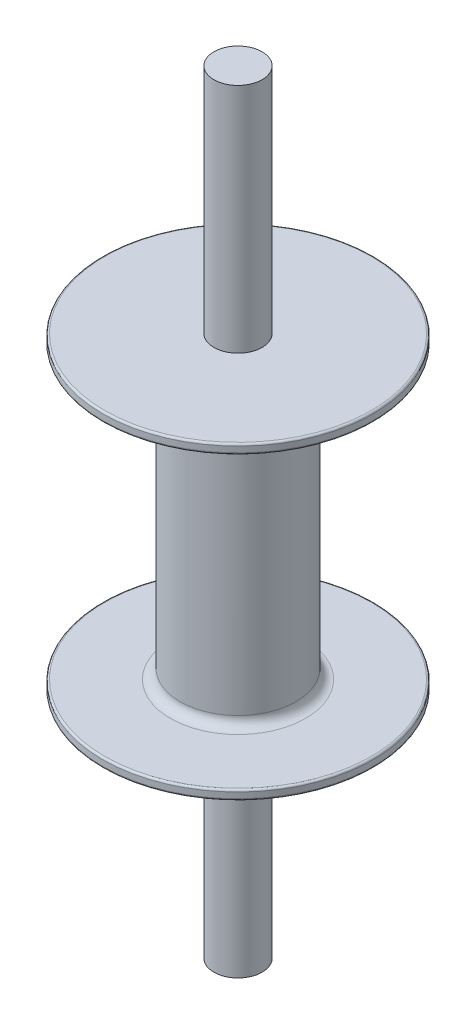
ISO-10303-21;
HEADER;
FILE_DESCRIPTION(('STEP AP214'),'2;1');
FILE_NAME('part.step','',(''),(''),'','','');
FILE_SCHEMA(('AUTOMOTIVE_DESIGN { 1 0 10303 214 1 1 1 1 }'));
ENDSEC;
DATA;
#1=APPLICATION_CONTEXT('core data for automotive mechanical design processes');
#2=APPLICATION_PROTOCOL_DEFINITION('international standard','automotive_design',2000,#1);
#3=PRODUCT_CONTEXT('',#1,'mechanical');
#4=PRODUCT('Part','Part','',(#3));
#5=PRODUCT_RELATED_PRODUCT_CATEGORY('part','',(#4));
#6=PRODUCT_DEFINITION_FORMATION('','',#4);
#7=PRODUCT_DEFINITION_CONTEXT('part definition',#1,'design');
#8=PRODUCT_DEFINITION('design','',#6,#7);
#9=PRODUCT_DEFINITION_SHAPE('','',#8);
#10=(LENGTH_UNIT() NAMED_UNIT(*) SI_UNIT(.MILLI.,.METRE.));
#11=(NAMED_UNIT(*) PLANE_ANGLE_UNIT() SI_UNIT($,.RADIAN.));
#12=(NAMED_UNIT(*) SI_UNIT($,.STERADIAN.) SOLID_ANGLE_UNIT());
#13=UNCERTAINTY_MEASURE_WITH_UNIT(LENGTH_MEASURE(1.E-05),#10,'distance_accuracy_value','');
#14=(GEOMETRIC_REPRESENTATION_CONTEXT(3) GLOBAL_UNCERTAINTY_ASSIGNED_CONTEXT((#13)) GLOBAL_UNIT_ASSIGNED_CONTEXT((#10,
#11,#12)) REPRESENTATION_CONTEXT('',''));
#15=CARTESIAN_POINT('',(0.,0.,0.));
#16=DIRECTION('',(0.,0.,1.));
#17=DIRECTION('',(1.,0.,0.));
#18=AXIS2_PLACEMENT_3D('',#15,#16,#17);
#19=CARTESIAN_POINT('',(0.,-150.,0.));
#20=DIRECTION('',(0.,1.,0.));
#21=DIRECTION('',(0.,0.,1.));
#22=AXIS2_PLACEMENT_3D('',#19,#20,#21);
#23=CYLINDRICAL_SURFACE('',#22,60.);
#24=CARTESIAN_POINT('',(0.,-140.,0.));
#25=DIRECTION('',(0.,-1.,0.));
#26=DIRECTION('',(0.,0.,-1.));
#27=AXIS2_PLACEMENT_3D('',#24,#25,#26);
#28=CIRCLE('',#27,60.);
#29=CARTESIAN_POINT('',(0.,-140.,-60.));
#30=VERTEX_POINT('',#29);
#31=EDGE_CURVE('E66',#30,#30,#28,.F.);
#32=ORIENTED_EDGE('',*,*,#31,.T.);
#33=EDGE_LOOP('',(#32));
#34=FACE_BOUND('',#33,.T.);
#35=CARTESIAN_POINT('',(0.,140.,0.));
#36=DIRECTION('',(0.,1.,0.));
#37=DIRECTION('',(0.,0.,1.));
#38=AXIS2_PLACEMENT_3D('',#35,#36,#37);
#39=CIRCLE('',#38,60.);
#40=CARTESIAN_POINT('',(0.,140.,60.));
#41=VERTEX_POINT('',#40);
#42=EDGE_CURVE('E69',#41,#41,#39,.F.);
#43=ORIENTED_EDGE('',*,*,#42,.T.);
#44=EDGE_LOOP('',(#43));
#45=FACE_BOUND('',#44,.T.);
#46=ADVANCED_FACE('F31',(#34,#45),#23,.T.);
#47=CARTESIAN_POINT('',(0.,160.,0.));
#48=DIRECTION('',(0.,-1.,0.));
#49=DIRECTION('',(0.,0.,-1.));
#50=AXIS2_PLACEMENT_3D('',#47,#48,#49);
#51=CYLINDRICAL_SURFACE('',#50,140.);
#52=CARTESIAN_POINT('',(0.,158.,0.));
#53=DIRECTION('',(0.,1.,0.));
#54=DIRECTION('',(0.,0.,1.));
#55=AXIS2_PLACEMENT_3D('',#52,#53,#54);
#56=CIRCLE('',#55,140.);
#57=CARTESIAN_POINT('',(0.,158.,140.));
#58=VERTEX_POINT('',#57);
#59=EDGE_CURVE('E42',#58,#58,#56,.F.);
#60=ORIENTED_EDGE('',*,*,#59,.T.);
#61=EDGE_LOOP('',(#60));
#62=FACE_BOUND('',#61,.T.);
#63=CARTESIAN_POINT('',(0.,152.,0.));
#64=DIRECTION('',(0.,1.,0.));
#65=DIRECTION('',(0.,0.,1.));
#66=AXIS2_PLACEMENT_3D('',#63,#64,#65);
#67=CIRCLE('',#66,140.);
#68=CARTESIAN_POINT('',(0.,152.,140.));
#69=VERTEX_POINT('',#68);
#70=EDGE_CURVE('E60',#69,#69,#67,.T.);
#71=ORIENTED_EDGE('',*,*,#70,.T.);
#72=EDGE_LOOP('',(#71));
#73=FACE_BOUND('',#72,.T.);
#74=ADVANCED_FACE('F106',(#62,#73),#51,.T.);
#75=CARTESIAN_POINT('',(0.,160.,0.));
#76=DIRECTION('',(0.,1.,0.));
#77=DIRECTION('',(0.,0.,1.));
#78=AXIS2_PLACEMENT_3D('',#75,#76,#77);
#79=PLANE('',#78);
#80=CARTESIAN_POINT('',(0.,160.,0.));
#81=DIRECTION('',(0.,1.,0.));
#82=DIRECTION('',(0.,0.,1.));
#83=AXIS2_PLACEMENT_3D('',#80,#81,#82);
#84=CIRCLE('',#83,138.);
#85=CARTESIAN_POINT('',(0.,160.,138.));
#86=VERTEX_POINT('',#85);
#87=EDGE_CURVE('E46',#86,#86,#84,.T.);
#88=ORIENTED_EDGE('',*,*,#87,.T.);
#89=EDGE_LOOP('',(#88));
#90=FACE_BOUND('',#89,.T.);
#91=CARTESIAN_POINT('',(0.,160.,0.));
#92=DIRECTION('',(0.,1.,0.));
#93=DIRECTION('',(0.,0.,1.));
#94=AXIS2_PLACEMENT_3D('',#91,#92,#93);
#95=CIRCLE('',#94,25.);
#96=CARTESIAN_POINT('',(0.,160.,25.));
#97=VERTEX_POINT('',#96);
#98=EDGE_CURVE('E75',#97,#97,#95,.T.);
#99=ORIENTED_EDGE('',*,*,#98,.F.);
#100=EDGE_LOOP('',(#99));
#101=FACE_BOUND('',#100,.T.);
#102=ADVANCED_FACE('F112',(#90,#101),#79,.T.);
#103=CARTESIAN_POINT('',(0.,150.,0.));
#104=DIRECTION('',(0.,1.,0.));
#105=DIRECTION('',(0.,0.,1.));
#106=AXIS2_PLACEMENT_3D('',#103,#104,#105);
#107=PLANE('',#106);
#108=CARTESIAN_POINT('',(0.,150.,0.));
#109=DIRECTION('',(0.,1.,0.));
#110=DIRECTION('',(0.,0.,1.));
#111=AXIS2_PLACEMENT_3D('',#108,#109,#110);
#112=CIRCLE('',#111,138.);
#113=CARTESIAN_POINT('',(0.,150.,138.));
#114=VERTEX_POINT('',#113);
#115=EDGE_CURVE('E57',#114,#114,#112,.F.);
#116=ORIENTED_EDGE('',*,*,#115,.T.);
#117=EDGE_LOOP('',(#116));
#118=FACE_BOUND('',#117,.T.);
#119=CARTESIAN_POINT('',(0.,150.,0.));
#120=DIRECTION('',(0.,1.,0.));
#121=DIRECTION('',(0.,0.,1.));
#122=AXIS2_PLACEMENT_3D('',#119,#120,#121);
#123=CIRCLE('',#122,70.);
#124=CARTESIAN_POINT('',(0.,150.,70.));
#125=VERTEX_POINT('',#124);
#126=EDGE_CURVE('E72',#125,#125,#123,.T.);
#127=ORIENTED_EDGE('',*,*,#126,.T.);
#128=EDGE_LOOP('',(#127));
#129=FACE_BOUND('',#128,.T.);
#130=ADVANCED_FACE('F145',(#118,#129),#107,.F.);
#131=CARTESIAN_POINT('',(0.,-160.,0.));
#132=DIRECTION('',(0.,1.,0.));
#133=DIRECTION('',(0.,0.,1.));
#134=AXIS2_PLACEMENT_3D('',#131,#132,#133);
#135=CYLINDRICAL_SURFACE('',#134,140.);
#136=CARTESIAN_POINT('',(0.,-158.,0.));
#137=DIRECTION('',(0.,-1.,0.));
#138=DIRECTION('',(0.,0.,-1.));
#139=AXIS2_PLACEMENT_3D('',#136,#137,#138);
#140=CIRCLE('',#139,140.);
#141=CARTESIAN_POINT('',(0.,-158.,-140.));
#142=VERTEX_POINT('',#141);
#143=EDGE_CURVE('E38',#142,#142,#140,.F.);
#144=ORIENTED_EDGE('',*,*,#143,.T.);
#145=EDGE_LOOP('',(#144));
#146=FACE_BOUND('',#145,.T.);
#147=CARTESIAN_POINT('',(0.,-152.,0.));
#148=DIRECTION('',(0.,-1.,0.));
#149=DIRECTION('',(0.,0.,-1.));
#150=AXIS2_PLACEMENT_3D('',#147,#148,#149);
#151=CIRCLE('',#150,140.);
#152=CARTESIAN_POINT('',(0.,-152.,-140.));
#153=VERTEX_POINT('',#152);
#154=EDGE_CURVE('E51',#153,#153,#151,.T.);
#155=ORIENTED_EDGE('',*,*,#154,.T.);
#156=EDGE_LOOP('',(#155));
#157=FACE_BOUND('',#156,.T.);
#158=ADVANCED_FACE('F151',(#146,#157),#135,.T.);
#159=CARTESIAN_POINT('',(0.,-160.,0.));
#160=DIRECTION('',(0.,-1.,0.));
#161=DIRECTION('',(0.,0.,1.));
#162=AXIS2_PLACEMENT_3D('',#159,#160,#161);
#163=PLANE('',#162);
#164=CARTESIAN_POINT('',(0.,-160.,0.));
#165=DIRECTION('',(0.,-1.,0.));
#166=DIRECTION('',(0.,0.,-1.));
#167=AXIS2_PLACEMENT_3D('',#164,#165,#166);
#168=CIRCLE('',#167,138.);
#169=CARTESIAN_POINT('',(0.,-160.,-138.));
#170=VERTEX_POINT('',#169);
#171=EDGE_CURVE('E10',#170,#170,#168,.T.);
#172=ORIENTED_EDGE('',*,*,#171,.T.);
#173=EDGE_LOOP('',(#172));
#174=FACE_BOUND('',#173,.T.);
#175=CARTESIAN_POINT('',(0.,-160.,0.));
#176=DIRECTION('',(0.,-1.,0.));
#177=DIRECTION('',(0.,0.,-1.));
#178=AXIS2_PLACEMENT_3D('',#175,#176,#177);
#179=CIRCLE('',#178,25.);
#180=CARTESIAN_POINT('',(0.,-160.,-25.));
#181=VERTEX_POINT('',#180);
#182=EDGE_CURVE('E76',#181,#181,#179,.T.);
#183=ORIENTED_EDGE('',*,*,#182,.F.);
#184=EDGE_LOOP('',(#183));
#185=FACE_BOUND('',#184,.T.);
#186=ADVANCED_FACE('F156',(#174,#185),#163,.T.);
#187=CARTESIAN_POINT('',(0.,-150.,0.));
#188=DIRECTION('',(0.,-1.,0.));
#189=DIRECTION('',(0.,0.,1.));
#190=AXIS2_PLACEMENT_3D('',#187,#188,#189);
#191=PLANE('',#190);
#192=CARTESIAN_POINT('',(0.,-150.,0.));
#193=DIRECTION('',(0.,-1.,0.));
#194=DIRECTION('',(0.,0.,-1.));
#195=AXIS2_PLACEMENT_3D('',#192,#193,#194);
#196=CIRCLE('',#195,138.);
#197=CARTESIAN_POINT('',(0.,-150.,-138.));
#198=VERTEX_POINT('',#197);
#199=EDGE_CURVE('E54',#198,#198,#196,.F.);
#200=ORIENTED_EDGE('',*,*,#199,.T.);
#201=EDGE_LOOP('',(#200));
#202=FACE_BOUND('',#201,.T.);
#203=CARTESIAN_POINT('',(0.,-150.,0.));
#204=DIRECTION('',(0.,-1.,0.));
#205=DIRECTION('',(0.,0.,-1.));
#206=AXIS2_PLACEMENT_3D('',#203,#204,#205);
#207=CIRCLE('',#206,70.);
#208=CARTESIAN_POINT('',(0.,-150.,-70.));
#209=VERTEX_POINT('',#208);
#210=EDGE_CURVE('E63',#209,#209,#207,.T.);
#211=ORIENTED_EDGE('',*,*,#210,.T.);
#212=EDGE_LOOP('',(#211));
#213=FACE_BOUND('',#212,.T.);
#214=ADVANCED_FACE('F157',(#202,#213),#191,.F.);
#215=CARTESIAN_POINT('',(0.,-400.,0.));
#216=DIRECTION('',(0.,1.,0.));
#217=DIRECTION('',(0.,0.,1.));
#218=AXIS2_PLACEMENT_3D('',#215,#216,#217);
#219=PLANE('',#218);
#220=CARTESIAN_POINT('',(0.,-400.,0.));
#221=DIRECTION('',(0.,1.,0.));
#222=DIRECTION('',(0.,0.,1.));
#223=AXIS2_PLACEMENT_3D('',#220,#221,#222);
#224=CIRCLE('',#223,25.);
#225=CARTESIAN_POINT('',(0.,-400.,25.));
#226=VERTEX_POINT('',#225);
#227=EDGE_CURVE('E79',#226,#226,#224,.T.);
#228=ORIENTED_EDGE('',*,*,#227,.F.);
#229=EDGE_LOOP('',(#228));
#230=FACE_BOUND('',#229,.T.);
#231=ADVANCED_FACE('F101',(#230),#219,.F.);
#232=CARTESIAN_POINT('',(0.,-400.,0.));
#233=DIRECTION('',(0.,1.,0.));
#234=DIRECTION('',(0.,0.,1.));
#235=AXIS2_PLACEMENT_3D('',#232,#233,#234);
#236=CYLINDRICAL_SURFACE('',#235,25.);
#237=ORIENTED_EDGE('',*,*,#182,.T.);
#238=EDGE_LOOP('',(#237));
#239=FACE_BOUND('',#238,.T.);
#240=ORIENTED_EDGE('',*,*,#227,.T.);
#241=EDGE_LOOP('',(#240));
#242=FACE_BOUND('',#241,.T.);
#243=ADVANCED_FACE('F92',(#239,#242),#236,.T.);
#244=ORIENTED_EDGE('',*,*,#98,.T.);
#245=EDGE_LOOP('',(#244));
#246=FACE_BOUND('',#245,.T.);
#247=CARTESIAN_POINT('',(0.,400.,0.));
#248=DIRECTION('',(0.,1.,0.));
#249=DIRECTION('',(0.,0.,1.));
#250=AXIS2_PLACEMENT_3D('',#247,#248,#249);
#251=CIRCLE('',#250,25.);
#252=CARTESIAN_POINT('',(0.,400.,25.));
#253=VERTEX_POINT('',#252);
#254=EDGE_CURVE('E84',#253,#253,#251,.T.);
#255=ORIENTED_EDGE('',*,*,#254,.F.);
#256=EDGE_LOOP('',(#255));
#257=FACE_BOUND('',#256,.T.);
#258=ADVANCED_FACE('F90',(#246,#257),#236,.T.);
#259=CARTESIAN_POINT('',(0.,400.,0.));
#260=DIRECTION('',(0.,1.,0.));
#261=DIRECTION('',(0.,0.,1.));
#262=AXIS2_PLACEMENT_3D('',#259,#260,#261);
#263=PLANE('',#262);
#264=ORIENTED_EDGE('',*,*,#254,.T.);
#265=EDGE_LOOP('',(#264));
#266=FACE_BOUND('',#265,.T.);
#267=ADVANCED_FACE('F88',(#266),#263,.T.);
#268=CARTESIAN_POINT('',(0.,140.,0.));
#269=DIRECTION('',(0.,1.,0.));
#270=DIRECTION('',(0.,0.,1.));
#271=AXIS2_PLACEMENT_3D('',#268,#269,#270);
#272=TOROIDAL_SURFACE('',#271,70.,10.);
#273=ORIENTED_EDGE('',*,*,#42,.F.);
#274=EDGE_LOOP('',(#273));
#275=FACE_BOUND('',#274,.T.);
#276=ORIENTED_EDGE('',*,*,#126,.F.);
#277=EDGE_LOOP('',(#276));
#278=FACE_BOUND('',#277,.T.);
#279=ADVANCED_FACE('F99',(#275,#278),#272,.F.);
#280=CARTESIAN_POINT('',(0.,-140.,0.));
#281=DIRECTION('',(0.,-1.,0.));
#282=DIRECTION('',(0.,0.,-1.));
#283=AXIS2_PLACEMENT_3D('',#280,#281,#282);
#284=TOROIDAL_SURFACE('',#283,70.,10.);
#285=ORIENTED_EDGE('',*,*,#210,.F.);
#286=EDGE_LOOP('',(#285));
#287=FACE_BOUND('',#286,.T.);
#288=ORIENTED_EDGE('',*,*,#31,.F.);
#289=EDGE_LOOP('',(#288));
#290=FACE_BOUND('',#289,.T.);
#291=ADVANCED_FACE('F120',(#287,#290),#284,.F.);
#292=CARTESIAN_POINT('',(0.,152.,0.));
#293=DIRECTION('',(0.,1.,0.));
#294=DIRECTION('',(0.,0.,1.));
#295=AXIS2_PLACEMENT_3D('',#292,#293,#294);
#296=TOROIDAL_SURFACE('',#295,138.,2.);
#297=ORIENTED_EDGE('',*,*,#115,.F.);
#298=EDGE_LOOP('',(#297));
#299=FACE_BOUND('',#298,.T.);
#300=ORIENTED_EDGE('',*,*,#70,.F.);
#301=EDGE_LOOP('',(#300));
#302=FACE_BOUND('',#301,.T.);
#303=ADVANCED_FACE('F124',(#299,#302),#296,.T.);
#304=CARTESIAN_POINT('',(0.,-152.,0.));
#305=DIRECTION('',(0.,-1.,0.));
#306=DIRECTION('',(0.,0.,-1.));
#307=AXIS2_PLACEMENT_3D('',#304,#305,#306);
#308=TOROIDAL_SURFACE('',#307,138.,2.);
#309=ORIENTED_EDGE('',*,*,#154,.F.);
#310=EDGE_LOOP('',(#309));
#311=FACE_BOUND('',#310,.T.);
#312=ORIENTED_EDGE('',*,*,#199,.F.);
#313=EDGE_LOOP('',(#312));
#314=FACE_BOUND('',#313,.T.);
#315=ADVANCED_FACE('F128',(#311,#314),#308,.T.);
#316=CARTESIAN_POINT('',(0.,158.,0.));
#317=DIRECTION('',(0.,1.,0.));
#318=DIRECTION('',(0.,0.,1.));
#319=AXIS2_PLACEMENT_3D('',#316,#317,#318);
#320=TOROIDAL_SURFACE('',#319,138.,2.);
#321=ORIENTED_EDGE('',*,*,#59,.F.);
#322=EDGE_LOOP('',(#321));
#323=FACE_BOUND('',#322,.T.);
#324=ORIENTED_EDGE('',*,*,#87,.F.);
#325=EDGE_LOOP('',(#324));
#326=FACE_BOUND('',#325,.T.);
#327=ADVANCED_FACE('F131',(#323,#326),#320,.T.);
#328=CARTESIAN_POINT('',(0.,-158.,0.));
#329=DIRECTION('',(0.,-1.,0.));
#330=DIRECTION('',(0.,0.,-1.));
#331=AXIS2_PLACEMENT_3D('',#328,#329,#330);
#332=TOROIDAL_SURFACE('',#331,138.,2.);
#333=ORIENTED_EDGE('',*,*,#171,.F.);
#334=EDGE_LOOP('',(#333));
#335=FACE_BOUND('',#334,.T.);
#336=ORIENTED_EDGE('',*,*,#143,.F.);
#337=EDGE_LOOP('',(#336));
#338=FACE_BOUND('',#337,.T.);
#339=ADVANCED_FACE('F33',(#335,#338),#332,.T.);
#340=CLOSED_SHELL('',(#46,#74,#102,#130,#158,#186,#214,#231,#243,#258,#267,#279,#291,#303,#315,
#327,#339));
#341=MANIFOLD_SOLID_BREP('B2',#340);
#342=ADVANCED_BREP_SHAPE_REPRESENTATION('',(#18,#341),#14);
#343=SHAPE_DEFINITION_REPRESENTATION(#9,#342);
ENDSEC;
END-ISO-10303-21;
